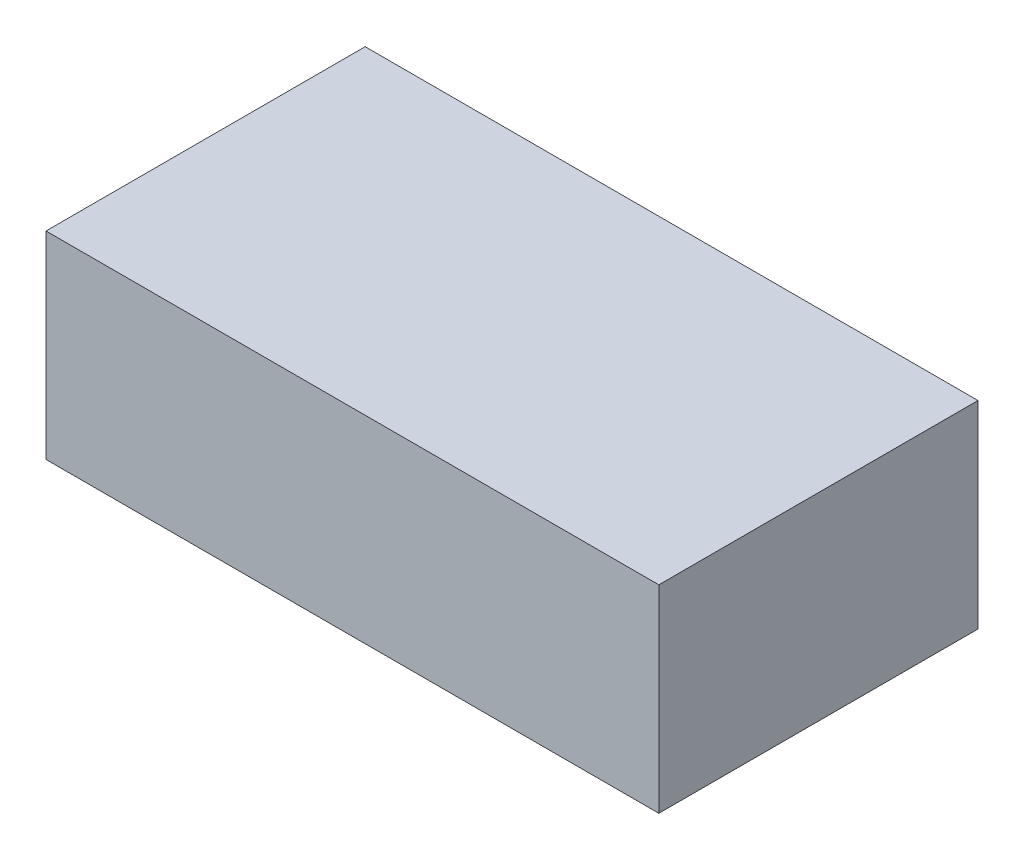
ISO-10303-21;
HEADER;
FILE_DESCRIPTION(('STEP AP214'),'2;1');
FILE_NAME('part.step','',(''),(''),'','','');
FILE_SCHEMA(('AUTOMOTIVE_DESIGN { 1 0 10303 214 1 1 1 1 }'));
ENDSEC;
DATA;
#1=APPLICATION_CONTEXT('core data for automotive mechanical design processes');
#2=APPLICATION_PROTOCOL_DEFINITION('international standard','automotive_design',2000,#1);
#3=PRODUCT_CONTEXT('',#1,'mechanical');
#4=PRODUCT('Part','Part','',(#3));
#5=PRODUCT_RELATED_PRODUCT_CATEGORY('part','',(#4));
#6=PRODUCT_DEFINITION_FORMATION('','',#4);
#7=PRODUCT_DEFINITION_CONTEXT('part definition',#1,'design');
#8=PRODUCT_DEFINITION('design','',#6,#7);
#9=PRODUCT_DEFINITION_SHAPE('','',#8);
#10=(LENGTH_UNIT() NAMED_UNIT(*) SI_UNIT(.MILLI.,.METRE.));
#11=(NAMED_UNIT(*) PLANE_ANGLE_UNIT() SI_UNIT($,.RADIAN.));
#12=(NAMED_UNIT(*) SI_UNIT($,.STERADIAN.) SOLID_ANGLE_UNIT());
#13=UNCERTAINTY_MEASURE_WITH_UNIT(LENGTH_MEASURE(1.E-05),#10,'distance_accuracy_value','');
#14=(GEOMETRIC_REPRESENTATION_CONTEXT(3) GLOBAL_UNCERTAINTY_ASSIGNED_CONTEXT((#13)) GLOBAL_UNIT_ASSIGNED_CONTEXT((#10,
#11,#12)) REPRESENTATION_CONTEXT('',''));
#15=CARTESIAN_POINT('',(0.,0.,0.));
#16=DIRECTION('',(0.,0.,1.));
#17=DIRECTION('',(1.,0.,0.));
#18=AXIS2_PLACEMENT_3D('',#15,#16,#17);
#19=CARTESIAN_POINT('',(-0.48,0.329999999999999,0.5));
#20=DIRECTION('',(1.,0.,0.));
#21=DIRECTION('',(0.,0.,-1.));
#22=AXIS2_PLACEMENT_3D('',#19,#20,#21);
#23=PLANE('',#22);
#24=DIRECTION('',(0.,-1.,0.));
#25=VECTOR('',#24,1.);
#26=CARTESIAN_POINT('',(-0.48,0.329999999999999,0.));
#27=LINE('',#26,#25);
#28=CARTESIAN_POINT('',(-0.48,0.329999999999999,0.));
#29=VERTEX_POINT('',#28);
#30=CARTESIAN_POINT('',(-0.48,0.02,0.));
#31=VERTEX_POINT('',#30);
#32=EDGE_CURVE('E11',#29,#31,#27,.T.);
#33=ORIENTED_EDGE('',*,*,#32,.T.);
#34=DIRECTION('',(0.,0.,-1.));
#35=VECTOR('',#34,1.);
#36=CARTESIAN_POINT('',(-0.48,0.02,0.5));
#37=LINE('',#36,#35);
#38=CARTESIAN_POINT('',(-0.48,0.02,0.5));
#39=VERTEX_POINT('',#38);
#40=EDGE_CURVE('E24',#39,#31,#37,.T.);
#41=ORIENTED_EDGE('',*,*,#40,.F.);
#42=DIRECTION('',(0.,-1.,0.));
#43=VECTOR('',#42,1.);
#44=CARTESIAN_POINT('',(-0.48,0.329999999999999,0.5));
#45=LINE('',#44,#43);
#46=CARTESIAN_POINT('',(-0.48,0.329999999999999,0.5));
#47=VERTEX_POINT('',#46);
#48=EDGE_CURVE('E88',#47,#39,#45,.T.);
#49=ORIENTED_EDGE('',*,*,#48,.F.);
#50=DIRECTION('',(0.,0.,-1.));
#51=VECTOR('',#50,1.);
#52=CARTESIAN_POINT('',(-0.48,0.329999999999999,0.5));
#53=LINE('',#52,#51);
#54=EDGE_CURVE('E77',#47,#29,#53,.T.);
#55=ORIENTED_EDGE('',*,*,#54,.T.);
#56=EDGE_LOOP('',(#33,#41,#49,#55));
#57=FACE_BOUND('',#56,.T.);
#58=ADVANCED_FACE('F17',(#57),#23,.F.);
#59=CARTESIAN_POINT('',(-0.48,0.02,0.5));
#60=DIRECTION('',(0.,1.,0.));
#61=DIRECTION('',(0.,0.,1.));
#62=AXIS2_PLACEMENT_3D('',#59,#60,#61);
#63=PLANE('',#62);
#64=DIRECTION('',(1.,0.,0.));
#65=VECTOR('',#64,1.);
#66=CARTESIAN_POINT('',(-0.48,0.02,0.));
#67=LINE('',#66,#65);
#68=CARTESIAN_POINT('',(0.48,0.02,0.));
#69=VERTEX_POINT('',#68);
#70=EDGE_CURVE('E85',#31,#69,#67,.T.);
#71=ORIENTED_EDGE('',*,*,#70,.T.);
#72=DIRECTION('',(0.,0.,-1.));
#73=VECTOR('',#72,1.);
#74=CARTESIAN_POINT('',(0.48,0.02,0.5));
#75=LINE('',#74,#73);
#76=CARTESIAN_POINT('',(0.48,0.02,0.5));
#77=VERTEX_POINT('',#76);
#78=EDGE_CURVE('E83',#77,#69,#75,.T.);
#79=ORIENTED_EDGE('',*,*,#78,.F.);
#80=DIRECTION('',(1.,0.,0.));
#81=VECTOR('',#80,1.);
#82=CARTESIAN_POINT('',(-0.48,0.02,0.5));
#83=LINE('',#82,#81);
#84=EDGE_CURVE('E72',#39,#77,#83,.T.);
#85=ORIENTED_EDGE('',*,*,#84,.F.);
#86=ORIENTED_EDGE('',*,*,#40,.T.);
#87=EDGE_LOOP('',(#71,#79,#85,#86));
#88=FACE_BOUND('',#87,.T.);
#89=ADVANCED_FACE('F90',(#88),#63,.F.);
#90=CARTESIAN_POINT('',(0.48,0.329999999999999,0.5));
#91=DIRECTION('',(-1.,0.,0.));
#92=DIRECTION('',(0.,0.,1.));
#93=AXIS2_PLACEMENT_3D('',#90,#91,#92);
#94=PLANE('',#93);
#95=DIRECTION('',(0.,1.,0.));
#96=VECTOR('',#95,1.);
#97=CARTESIAN_POINT('',(0.48,0.329999999999999,0.));
#98=LINE('',#97,#96);
#99=CARTESIAN_POINT('',(0.48,0.329999999999999,0.));
#100=VERTEX_POINT('',#99);
#101=EDGE_CURVE('E60',#69,#100,#98,.T.);
#102=ORIENTED_EDGE('',*,*,#101,.T.);
#103=DIRECTION('',(0.,0.,-1.));
#104=VECTOR('',#103,1.);
#105=CARTESIAN_POINT('',(0.48,0.329999999999999,0.5));
#106=LINE('',#105,#104);
#107=CARTESIAN_POINT('',(0.48,0.329999999999999,0.5));
#108=VERTEX_POINT('',#107);
#109=EDGE_CURVE('E54',#108,#100,#106,.T.);
#110=ORIENTED_EDGE('',*,*,#109,.F.);
#111=DIRECTION('',(0.,1.,0.));
#112=VECTOR('',#111,1.);
#113=CARTESIAN_POINT('',(0.48,0.329999999999999,0.5));
#114=LINE('',#113,#112);
#115=EDGE_CURVE('E58',#77,#108,#114,.T.);
#116=ORIENTED_EDGE('',*,*,#115,.F.);
#117=ORIENTED_EDGE('',*,*,#78,.T.);
#118=EDGE_LOOP('',(#102,#110,#116,#117));
#119=FACE_BOUND('',#118,.T.);
#120=ADVANCED_FACE('F56',(#119),#94,.F.);
#121=CARTESIAN_POINT('',(-0.48,0.329999999999999,0.5));
#122=DIRECTION('',(0.,-1.,0.));
#123=DIRECTION('',(0.,0.,-1.));
#124=AXIS2_PLACEMENT_3D('',#121,#122,#123);
#125=PLANE('',#124);
#126=DIRECTION('',(-1.,0.,0.));
#127=VECTOR('',#126,1.);
#128=CARTESIAN_POINT('',(-0.48,0.329999999999999,0.));
#129=LINE('',#128,#127);
#130=EDGE_CURVE('E73',#100,#29,#129,.T.);
#131=ORIENTED_EDGE('',*,*,#130,.T.);
#132=ORIENTED_EDGE('',*,*,#54,.F.);
#133=DIRECTION('',(-1.,0.,0.));
#134=VECTOR('',#133,1.);
#135=CARTESIAN_POINT('',(-0.48,0.329999999999999,0.5));
#136=LINE('',#135,#134);
#137=EDGE_CURVE('E70',#108,#47,#136,.T.);
#138=ORIENTED_EDGE('',*,*,#137,.F.);
#139=ORIENTED_EDGE('',*,*,#109,.T.);
#140=EDGE_LOOP('',(#131,#132,#138,#139));
#141=FACE_BOUND('',#140,.T.);
#142=ADVANCED_FACE('F76',(#141),#125,.F.);
#143=CARTESIAN_POINT('',(-0.48,0.02,0.5));
#144=DIRECTION('',(0.,0.,1.));
#145=DIRECTION('',(1.,0.,0.));
#146=AXIS2_PLACEMENT_3D('',#143,#144,#145);
#147=PLANE('',#146);
#148=ORIENTED_EDGE('',*,*,#48,.T.);
#149=ORIENTED_EDGE('',*,*,#84,.T.);
#150=ORIENTED_EDGE('',*,*,#115,.T.);
#151=ORIENTED_EDGE('',*,*,#137,.T.);
#152=EDGE_LOOP('',(#148,#149,#150,#151));
#153=FACE_BOUND('',#152,.T.);
#154=ADVANCED_FACE('F69',(#153),#147,.T.);
#155=CARTESIAN_POINT('',(-0.48,0.02,0.));
#156=DIRECTION('',(0.,0.,1.));
#157=DIRECTION('',(1.,0.,0.));
#158=AXIS2_PLACEMENT_3D('',#155,#156,#157);
#159=PLANE('',#158);
#160=ORIENTED_EDGE('',*,*,#32,.F.);
#161=ORIENTED_EDGE('',*,*,#130,.F.);
#162=ORIENTED_EDGE('',*,*,#101,.F.);
#163=ORIENTED_EDGE('',*,*,#70,.F.);
#164=EDGE_LOOP('',(#160,#161,#162,#163));
#165=FACE_BOUND('',#164,.T.);
#166=ADVANCED_FACE('F91',(#165),#159,.F.);
#167=CLOSED_SHELL('',(#58,#89,#120,#142,#154,#166));
#168=MANIFOLD_SOLID_BREP('B1',#167);
#169=ADVANCED_BREP_SHAPE_REPRESENTATION('',(#18,#168),#14);
#170=SHAPE_DEFINITION_REPRESENTATION(#9,#169);
ENDSEC;
END-ISO-10303-21;
